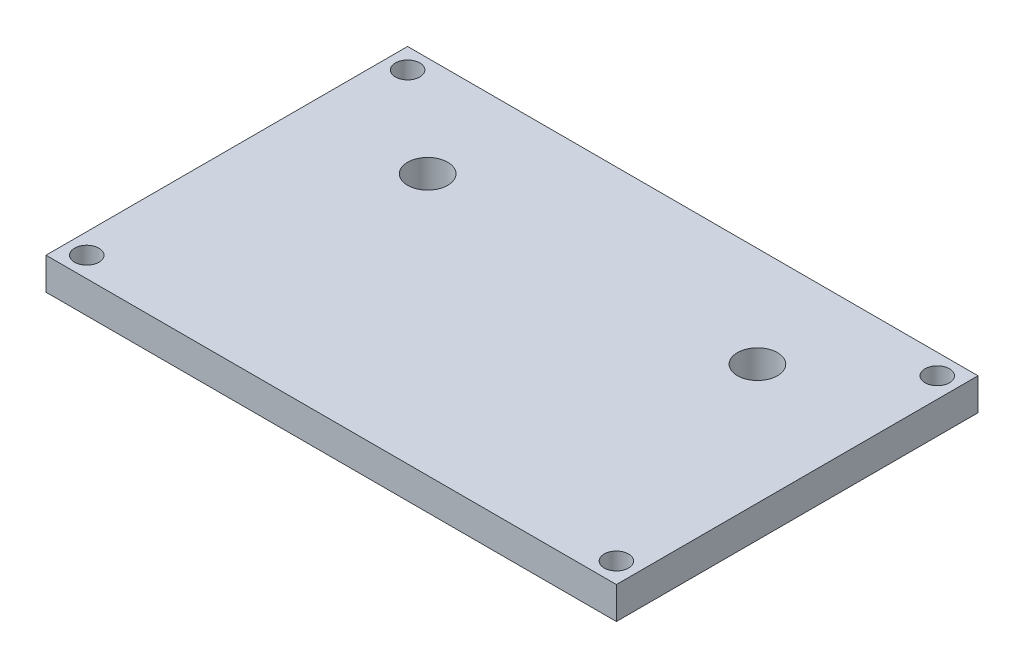
ISO-10303-21;
HEADER;
FILE_DESCRIPTION(('STEP AP214'),'2;1');
FILE_NAME('part.step','',(''),(''),'','','');
FILE_SCHEMA(('AUTOMOTIVE_DESIGN { 1 0 10303 214 1 1 1 1 }'));
ENDSEC;
DATA;
#1=APPLICATION_CONTEXT('core data for automotive mechanical design processes');
#2=APPLICATION_PROTOCOL_DEFINITION('international standard','automotive_design',2000,#1);
#3=PRODUCT_CONTEXT('',#1,'mechanical');
#4=PRODUCT('Part','Part','',(#3));
#5=PRODUCT_RELATED_PRODUCT_CATEGORY('part','',(#4));
#6=PRODUCT_DEFINITION_FORMATION('','',#4);
#7=PRODUCT_DEFINITION_CONTEXT('part definition',#1,'design');
#8=PRODUCT_DEFINITION('design','',#6,#7);
#9=PRODUCT_DEFINITION_SHAPE('','',#8);
#10=(LENGTH_UNIT() NAMED_UNIT(*) SI_UNIT(.MILLI.,.METRE.));
#11=(NAMED_UNIT(*) PLANE_ANGLE_UNIT() SI_UNIT($,.RADIAN.));
#12=(NAMED_UNIT(*) SI_UNIT($,.STERADIAN.) SOLID_ANGLE_UNIT());
#13=UNCERTAINTY_MEASURE_WITH_UNIT(LENGTH_MEASURE(1.E-05),#10,'distance_accuracy_value','');
#14=(GEOMETRIC_REPRESENTATION_CONTEXT(3) GLOBAL_UNCERTAINTY_ASSIGNED_CONTEXT((#13)) GLOBAL_UNIT_ASSIGNED_CONTEXT((#10,
#11,#12)) REPRESENTATION_CONTEXT('',''));
#15=CARTESIAN_POINT('',(0.,0.,0.));
#16=DIRECTION('',(0.,0.,1.));
#17=DIRECTION('',(1.,0.,0.));
#18=AXIS2_PLACEMENT_3D('',#15,#16,#17);
#19=CARTESIAN_POINT('',(0.,4.,0.));
#20=DIRECTION('',(0.,1.,0.));
#21=DIRECTION('',(0.,0.,1.));
#22=AXIS2_PLACEMENT_3D('',#19,#20,#21);
#23=PLANE('',#22);
#24=CARTESIAN_POINT('',(-20.56,4.,-10.0425));
#25=DIRECTION('',(0.,1.,0.));
#26=DIRECTION('',(0.,0.,1.));
#27=AXIS2_PLACEMENT_3D('',#24,#25,#26);
#28=CIRCLE('',#27,2.5);
#29=CARTESIAN_POINT('',(-20.56,4.,-7.5425));
#30=VERTEX_POINT('',#29);
#31=EDGE_CURVE('E139',#30,#30,#28,.T.);
#32=ORIENTED_EDGE('',*,*,#31,.F.);
#33=EDGE_LOOP('',(#32));
#34=FACE_BOUND('',#33,.T.);
#35=CARTESIAN_POINT('',(33.02,4.,20.0025));
#36=DIRECTION('',(0.,1.,0.));
#37=DIRECTION('',(0.,0.,1.));
#38=AXIS2_PLACEMENT_3D('',#35,#36,#37);
#39=CIRCLE('',#38,1.52400000000001);
#40=CARTESIAN_POINT('',(33.02,4.,21.5265));
#41=VERTEX_POINT('',#40);
#42=EDGE_CURVE('E169',#41,#41,#39,.T.);
#43=ORIENTED_EDGE('',*,*,#42,.F.);
#44=EDGE_LOOP('',(#43));
#45=FACE_BOUND('',#44,.T.);
#46=CARTESIAN_POINT('',(-33.02,4.,-20.0025));
#47=DIRECTION('',(0.,1.,0.));
#48=DIRECTION('',(0.,0.,1.));
#49=AXIS2_PLACEMENT_3D('',#46,#47,#48);
#50=CIRCLE('',#49,1.52400000000001);
#51=CARTESIAN_POINT('',(-33.02,4.,-18.4785));
#52=VERTEX_POINT('',#51);
#53=EDGE_CURVE('E170',#52,#52,#50,.T.);
#54=ORIENTED_EDGE('',*,*,#53,.F.);
#55=EDGE_LOOP('',(#54));
#56=FACE_BOUND('',#55,.T.);
#57=DIRECTION('',(0.,0.,-1.));
#58=VECTOR('',#57,1.);
#59=CARTESIAN_POINT('',(35.56,4.,-22.5425));
#60=LINE('',#59,#58);
#61=CARTESIAN_POINT('',(35.56,4.,22.5425));
#62=VERTEX_POINT('',#61);
#63=CARTESIAN_POINT('',(35.56,4.,-22.5425));
#64=VERTEX_POINT('',#63);
#65=EDGE_CURVE('E97',#62,#64,#60,.T.);
#66=ORIENTED_EDGE('',*,*,#65,.T.);
#67=DIRECTION('',(-1.,0.,0.));
#68=VECTOR('',#67,1.);
#69=CARTESIAN_POINT('',(-35.56,4.,-22.5425));
#70=LINE('',#69,#68);
#71=CARTESIAN_POINT('',(-35.56,4.,-22.5425));
#72=VERTEX_POINT('',#71);
#73=EDGE_CURVE('E92',#64,#72,#70,.T.);
#74=ORIENTED_EDGE('',*,*,#73,.T.);
#75=DIRECTION('',(0.,0.,1.));
#76=VECTOR('',#75,1.);
#77=CARTESIAN_POINT('',(-35.56,4.,-22.5425));
#78=LINE('',#77,#76);
#79=CARTESIAN_POINT('',(-35.56,4.,22.5425));
#80=VERTEX_POINT('',#79);
#81=EDGE_CURVE('E95',#72,#80,#78,.T.);
#82=ORIENTED_EDGE('',*,*,#81,.T.);
#83=DIRECTION('',(1.,0.,0.));
#84=VECTOR('',#83,1.);
#85=CARTESIAN_POINT('',(-35.56,4.,22.5425));
#86=LINE('',#85,#84);
#87=EDGE_CURVE('E62',#80,#62,#86,.T.);
#88=ORIENTED_EDGE('',*,*,#87,.T.);
#89=EDGE_LOOP('',(#66,#74,#82,#88));
#90=FACE_BOUND('',#89,.T.);
#91=CARTESIAN_POINT('',(33.02,4.,-20.0025));
#92=DIRECTION('',(0.,1.,0.));
#93=DIRECTION('',(0.,0.,-1.));
#94=AXIS2_PLACEMENT_3D('',#91,#92,#93);
#95=CIRCLE('',#94,1.52400000000001);
#96=CARTESIAN_POINT('',(33.02,4.,-21.5265));
#97=VERTEX_POINT('',#96);
#98=EDGE_CURVE('E160',#97,#97,#95,.T.);
#99=ORIENTED_EDGE('',*,*,#98,.F.);
#100=EDGE_LOOP('',(#99));
#101=FACE_BOUND('',#100,.T.);
#102=CARTESIAN_POINT('',(-33.02,4.,20.0025));
#103=DIRECTION('',(0.,1.,0.));
#104=DIRECTION('',(0.,0.,-1.));
#105=AXIS2_PLACEMENT_3D('',#102,#103,#104);
#106=CIRCLE('',#105,1.52400000000001);
#107=CARTESIAN_POINT('',(-33.02,4.,18.4785));
#108=VERTEX_POINT('',#107);
#109=EDGE_CURVE('E151',#108,#108,#106,.T.);
#110=ORIENTED_EDGE('',*,*,#109,.F.);
#111=EDGE_LOOP('',(#110));
#112=FACE_BOUND('',#111,.T.);
#113=CARTESIAN_POINT('',(20.56,4.,-10.0425));
#114=DIRECTION('',(0.,1.,0.));
#115=DIRECTION('',(0.,0.,-1.));
#116=AXIS2_PLACEMENT_3D('',#113,#114,#115);
#117=CIRCLE('',#116,2.5);
#118=CARTESIAN_POINT('',(20.56,4.,-12.5425));
#119=VERTEX_POINT('',#118);
#120=EDGE_CURVE('E150',#119,#119,#117,.T.);
#121=ORIENTED_EDGE('',*,*,#120,.F.);
#122=EDGE_LOOP('',(#121));
#123=FACE_BOUND('',#122,.T.);
#124=ADVANCED_FACE('F45',(#34,#45,#56,#90,#101,#112,#123),#23,.T.);
#125=CARTESIAN_POINT('',(0.,0.,0.));
#126=DIRECTION('',(0.,1.,0.));
#127=DIRECTION('',(0.,0.,1.));
#128=AXIS2_PLACEMENT_3D('',#125,#126,#127);
#129=PLANE('',#128);
#130=DIRECTION('',(0.,0.,-1.));
#131=VECTOR('',#130,1.);
#132=CARTESIAN_POINT('',(35.56,0.,-22.5425));
#133=LINE('',#132,#131);
#134=CARTESIAN_POINT('',(35.56,0.,22.5425));
#135=VERTEX_POINT('',#134);
#136=CARTESIAN_POINT('',(35.56,0.,-22.5425));
#137=VERTEX_POINT('',#136);
#138=EDGE_CURVE('E111',#135,#137,#133,.T.);
#139=ORIENTED_EDGE('',*,*,#138,.F.);
#140=DIRECTION('',(1.,0.,0.));
#141=VECTOR('',#140,1.);
#142=CARTESIAN_POINT('',(-35.56,0.,22.5425));
#143=LINE('',#142,#141);
#144=CARTESIAN_POINT('',(-35.56,0.,22.5425));
#145=VERTEX_POINT('',#144);
#146=EDGE_CURVE('E85',#145,#135,#143,.T.);
#147=ORIENTED_EDGE('',*,*,#146,.F.);
#148=DIRECTION('',(0.,0.,1.));
#149=VECTOR('',#148,1.);
#150=CARTESIAN_POINT('',(-35.56,0.,-22.5425));
#151=LINE('',#150,#149);
#152=CARTESIAN_POINT('',(-35.56,0.,-22.5425));
#153=VERTEX_POINT('',#152);
#154=EDGE_CURVE('E79',#153,#145,#151,.T.);
#155=ORIENTED_EDGE('',*,*,#154,.F.);
#156=DIRECTION('',(-1.,0.,0.));
#157=VECTOR('',#156,1.);
#158=CARTESIAN_POINT('',(-35.56,0.,-22.5425));
#159=LINE('',#158,#157);
#160=EDGE_CURVE('E101',#137,#153,#159,.T.);
#161=ORIENTED_EDGE('',*,*,#160,.F.);
#162=EDGE_LOOP('',(#139,#147,#155,#161));
#163=FACE_BOUND('',#162,.T.);
#164=CARTESIAN_POINT('',(-33.02,0.,-20.0025));
#165=DIRECTION('',(0.,1.,0.));
#166=DIRECTION('',(0.,0.,1.));
#167=AXIS2_PLACEMENT_3D('',#164,#165,#166);
#168=CIRCLE('',#167,1.52400000000001);
#169=CARTESIAN_POINT('',(-33.02,0.,-18.4785));
#170=VERTEX_POINT('',#169);
#171=EDGE_CURVE('E166',#170,#170,#168,.T.);
#172=ORIENTED_EDGE('',*,*,#171,.T.);
#173=EDGE_LOOP('',(#172));
#174=FACE_BOUND('',#173,.T.);
#175=CARTESIAN_POINT('',(33.02,0.,-20.0025));
#176=DIRECTION('',(0.,1.,0.));
#177=DIRECTION('',(0.,0.,-1.));
#178=AXIS2_PLACEMENT_3D('',#175,#176,#177);
#179=CIRCLE('',#178,1.52400000000001);
#180=CARTESIAN_POINT('',(33.02,0.,-21.5265));
#181=VERTEX_POINT('',#180);
#182=EDGE_CURVE('E167',#181,#181,#179,.T.);
#183=ORIENTED_EDGE('',*,*,#182,.T.);
#184=EDGE_LOOP('',(#183));
#185=FACE_BOUND('',#184,.T.);
#186=CARTESIAN_POINT('',(33.02,0.,20.0025));
#187=DIRECTION('',(0.,1.,0.));
#188=DIRECTION('',(0.,0.,1.));
#189=AXIS2_PLACEMENT_3D('',#186,#187,#188);
#190=CIRCLE('',#189,1.52400000000001);
#191=CARTESIAN_POINT('',(33.02,0.,21.5265));
#192=VERTEX_POINT('',#191);
#193=EDGE_CURVE('E156',#192,#192,#190,.T.);
#194=ORIENTED_EDGE('',*,*,#193,.T.);
#195=EDGE_LOOP('',(#194));
#196=FACE_BOUND('',#195,.T.);
#197=CARTESIAN_POINT('',(-33.02,0.,20.0025));
#198=DIRECTION('',(0.,1.,0.));
#199=DIRECTION('',(0.,0.,-1.));
#200=AXIS2_PLACEMENT_3D('',#197,#198,#199);
#201=CIRCLE('',#200,1.52400000000001);
#202=CARTESIAN_POINT('',(-33.02,0.,18.4785));
#203=VERTEX_POINT('',#202);
#204=EDGE_CURVE('E145',#203,#203,#201,.T.);
#205=ORIENTED_EDGE('',*,*,#204,.T.);
#206=EDGE_LOOP('',(#205));
#207=FACE_BOUND('',#206,.T.);
#208=CARTESIAN_POINT('',(-20.56,0.,-10.0425));
#209=DIRECTION('',(0.,1.,0.));
#210=DIRECTION('',(0.,0.,1.));
#211=AXIS2_PLACEMENT_3D('',#208,#209,#210);
#212=CIRCLE('',#211,2.5);
#213=CARTESIAN_POINT('',(-20.56,0.,-7.5425));
#214=VERTEX_POINT('',#213);
#215=EDGE_CURVE('E146',#214,#214,#212,.T.);
#216=ORIENTED_EDGE('',*,*,#215,.T.);
#217=EDGE_LOOP('',(#216));
#218=FACE_BOUND('',#217,.T.);
#219=CARTESIAN_POINT('',(20.56,0.,-10.0425));
#220=DIRECTION('',(0.,1.,0.));
#221=DIRECTION('',(0.,0.,-1.));
#222=AXIS2_PLACEMENT_3D('',#219,#220,#221);
#223=CIRCLE('',#222,2.5);
#224=CARTESIAN_POINT('',(20.56,0.,-12.5425));
#225=VERTEX_POINT('',#224);
#226=EDGE_CURVE('E147',#225,#225,#223,.T.);
#227=ORIENTED_EDGE('',*,*,#226,.T.);
#228=EDGE_LOOP('',(#227));
#229=FACE_BOUND('',#228,.T.);
#230=ADVANCED_FACE('F182',(#163,#174,#185,#196,#207,#218,#229),#129,.F.);
#231=CARTESIAN_POINT('',(35.56,4.,-22.5425));
#232=DIRECTION('',(-1.,0.,0.));
#233=DIRECTION('',(0.,0.,1.));
#234=AXIS2_PLACEMENT_3D('',#231,#232,#233);
#235=PLANE('',#234);
#236=ORIENTED_EDGE('',*,*,#138,.T.);
#237=DIRECTION('',(0.,-1.,0.));
#238=VECTOR('',#237,1.);
#239=CARTESIAN_POINT('',(35.56,4.,-22.5425));
#240=LINE('',#239,#238);
#241=EDGE_CURVE('E12',#64,#137,#240,.T.);
#242=ORIENTED_EDGE('',*,*,#241,.F.);
#243=ORIENTED_EDGE('',*,*,#65,.F.);
#244=DIRECTION('',(0.,-1.,0.));
#245=VECTOR('',#244,1.);
#246=CARTESIAN_POINT('',(35.56,4.,22.5425));
#247=LINE('',#246,#245);
#248=EDGE_CURVE('E106',#62,#135,#247,.T.);
#249=ORIENTED_EDGE('',*,*,#248,.T.);
#250=EDGE_LOOP('',(#236,#242,#243,#249));
#251=FACE_BOUND('',#250,.T.);
#252=ADVANCED_FACE('F47',(#251),#235,.F.);
#253=CARTESIAN_POINT('',(-35.56,4.,-22.5425));
#254=DIRECTION('',(0.,0.,1.));
#255=DIRECTION('',(1.,0.,0.));
#256=AXIS2_PLACEMENT_3D('',#253,#254,#255);
#257=PLANE('',#256);
#258=ORIENTED_EDGE('',*,*,#160,.T.);
#259=DIRECTION('',(0.,-1.,0.));
#260=VECTOR('',#259,1.);
#261=CARTESIAN_POINT('',(-35.56,4.,-22.5425));
#262=LINE('',#261,#260);
#263=EDGE_CURVE('E54',#72,#153,#262,.T.);
#264=ORIENTED_EDGE('',*,*,#263,.F.);
#265=ORIENTED_EDGE('',*,*,#73,.F.);
#266=ORIENTED_EDGE('',*,*,#241,.T.);
#267=EDGE_LOOP('',(#258,#264,#265,#266));
#268=FACE_BOUND('',#267,.T.);
#269=ADVANCED_FACE('F100',(#268),#257,.F.);
#270=CARTESIAN_POINT('',(-35.56,4.,-22.5425));
#271=DIRECTION('',(1.,0.,0.));
#272=DIRECTION('',(0.,0.,-1.));
#273=AXIS2_PLACEMENT_3D('',#270,#271,#272);
#274=PLANE('',#273);
#275=ORIENTED_EDGE('',*,*,#154,.T.);
#276=DIRECTION('',(0.,-1.,0.));
#277=VECTOR('',#276,1.);
#278=CARTESIAN_POINT('',(-35.56,4.,22.5425));
#279=LINE('',#278,#277);
#280=EDGE_CURVE('E102',#80,#145,#279,.T.);
#281=ORIENTED_EDGE('',*,*,#280,.F.);
#282=ORIENTED_EDGE('',*,*,#81,.F.);
#283=ORIENTED_EDGE('',*,*,#263,.T.);
#284=EDGE_LOOP('',(#275,#281,#282,#283));
#285=FACE_BOUND('',#284,.T.);
#286=ADVANCED_FACE('F103',(#285),#274,.F.);
#287=CARTESIAN_POINT('',(-35.56,4.,22.5425));
#288=DIRECTION('',(0.,0.,-1.));
#289=DIRECTION('',(-1.,0.,0.));
#290=AXIS2_PLACEMENT_3D('',#287,#288,#289);
#291=PLANE('',#290);
#292=ORIENTED_EDGE('',*,*,#146,.T.);
#293=ORIENTED_EDGE('',*,*,#248,.F.);
#294=ORIENTED_EDGE('',*,*,#87,.F.);
#295=ORIENTED_EDGE('',*,*,#280,.T.);
#296=EDGE_LOOP('',(#292,#293,#294,#295));
#297=FACE_BOUND('',#296,.T.);
#298=ADVANCED_FACE('F221',(#297),#291,.F.);
#299=CARTESIAN_POINT('',(-33.02,4.,-20.0025));
#300=DIRECTION('',(0.,-1.,0.));
#301=DIRECTION('',(0.,0.,-1.));
#302=AXIS2_PLACEMENT_3D('',#299,#300,#301);
#303=CYLINDRICAL_SURFACE('',#302,1.52400000000001);
#304=ORIENTED_EDGE('',*,*,#53,.T.);
#305=EDGE_LOOP('',(#304));
#306=FACE_BOUND('',#305,.T.);
#307=ORIENTED_EDGE('',*,*,#171,.F.);
#308=EDGE_LOOP('',(#307));
#309=FACE_BOUND('',#308,.T.);
#310=ADVANCED_FACE('F218',(#306,#309),#303,.F.);
#311=CARTESIAN_POINT('',(33.02,4.,-20.0025));
#312=DIRECTION('',(0.,-1.,0.));
#313=DIRECTION('',(0.,0.,-1.));
#314=AXIS2_PLACEMENT_3D('',#311,#312,#313);
#315=CYLINDRICAL_SURFACE('',#314,1.52400000000001);
#316=ORIENTED_EDGE('',*,*,#98,.T.);
#317=EDGE_LOOP('',(#316));
#318=FACE_BOUND('',#317,.T.);
#319=ORIENTED_EDGE('',*,*,#182,.F.);
#320=EDGE_LOOP('',(#319));
#321=FACE_BOUND('',#320,.T.);
#322=ADVANCED_FACE('F273',(#318,#321),#315,.F.);
#323=CARTESIAN_POINT('',(33.02,4.,20.0025));
#324=DIRECTION('',(0.,-1.,0.));
#325=DIRECTION('',(0.,0.,-1.));
#326=AXIS2_PLACEMENT_3D('',#323,#324,#325);
#327=CYLINDRICAL_SURFACE('',#326,1.52400000000001);
#328=ORIENTED_EDGE('',*,*,#42,.T.);
#329=EDGE_LOOP('',(#328));
#330=FACE_BOUND('',#329,.T.);
#331=ORIENTED_EDGE('',*,*,#193,.F.);
#332=EDGE_LOOP('',(#331));
#333=FACE_BOUND('',#332,.T.);
#334=ADVANCED_FACE('F282',(#330,#333),#327,.F.);
#335=CARTESIAN_POINT('',(-33.02,4.,20.0025));
#336=DIRECTION('',(0.,-1.,0.));
#337=DIRECTION('',(0.,0.,-1.));
#338=AXIS2_PLACEMENT_3D('',#335,#336,#337);
#339=CYLINDRICAL_SURFACE('',#338,1.52400000000001);
#340=ORIENTED_EDGE('',*,*,#109,.T.);
#341=EDGE_LOOP('',(#340));
#342=FACE_BOUND('',#341,.T.);
#343=ORIENTED_EDGE('',*,*,#204,.F.);
#344=EDGE_LOOP('',(#343));
#345=FACE_BOUND('',#344,.T.);
#346=ADVANCED_FACE('F291',(#342,#345),#339,.F.);
#347=CARTESIAN_POINT('',(-20.56,4.,-10.0425));
#348=DIRECTION('',(0.,-1.,0.));
#349=DIRECTION('',(0.,0.,-1.));
#350=AXIS2_PLACEMENT_3D('',#347,#348,#349);
#351=CYLINDRICAL_SURFACE('',#350,2.5);
#352=ORIENTED_EDGE('',*,*,#31,.T.);
#353=EDGE_LOOP('',(#352));
#354=FACE_BOUND('',#353,.T.);
#355=ORIENTED_EDGE('',*,*,#215,.F.);
#356=EDGE_LOOP('',(#355));
#357=FACE_BOUND('',#356,.T.);
#358=ADVANCED_FACE('F301',(#354,#357),#351,.F.);
#359=CARTESIAN_POINT('',(20.56,4.,-10.0425));
#360=DIRECTION('',(0.,-1.,0.));
#361=DIRECTION('',(0.,0.,-1.));
#362=AXIS2_PLACEMENT_3D('',#359,#360,#361);
#363=CYLINDRICAL_SURFACE('',#362,2.5);
#364=ORIENTED_EDGE('',*,*,#120,.T.);
#365=EDGE_LOOP('',(#364));
#366=FACE_BOUND('',#365,.T.);
#367=ORIENTED_EDGE('',*,*,#226,.F.);
#368=EDGE_LOOP('',(#367));
#369=FACE_BOUND('',#368,.T.);
#370=ADVANCED_FACE('F208',(#366,#369),#363,.F.);
#371=CLOSED_SHELL('',(#124,#230,#252,#269,#286,#298,#310,#322,#334,#346,#358,#370));
#372=MANIFOLD_SOLID_BREP('B2',#371);
#373=ADVANCED_BREP_SHAPE_REPRESENTATION('',(#18,#372),#14);
#374=SHAPE_DEFINITION_REPRESENTATION(#9,#373);
ENDSEC;
END-ISO-10303-21;
